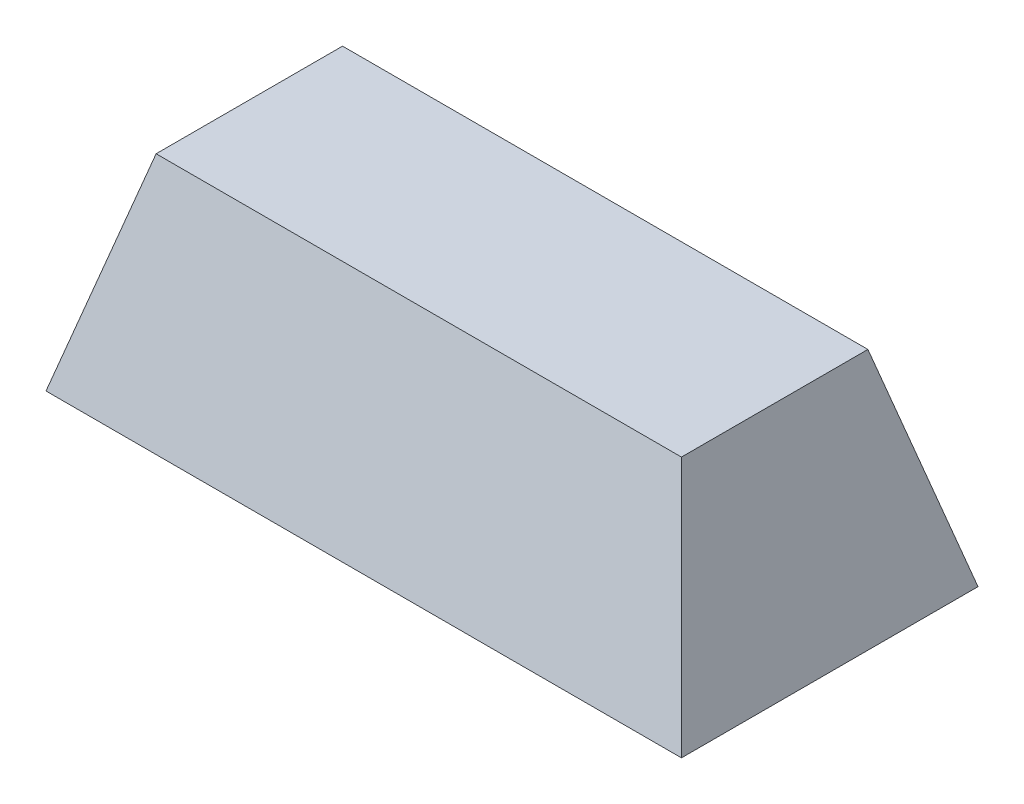
ISO-10303-21;
HEADER;
FILE_DESCRIPTION(('STEP AP214'),'2;1');
FILE_NAME('part.step','',(''),(''),'','','');
FILE_SCHEMA(('AUTOMOTIVE_DESIGN { 1 0 10303 214 1 1 1 1 }'));
ENDSEC;
DATA;
#1=APPLICATION_CONTEXT('core data for automotive mechanical design processes');
#2=APPLICATION_PROTOCOL_DEFINITION('international standard','automotive_design',2000,#1);
#3=PRODUCT_CONTEXT('',#1,'mechanical');
#4=PRODUCT('Part','Part','',(#3));
#5=PRODUCT_RELATED_PRODUCT_CATEGORY('part','',(#4));
#6=PRODUCT_DEFINITION_FORMATION('','',#4);
#7=PRODUCT_DEFINITION_CONTEXT('part definition',#1,'design');
#8=PRODUCT_DEFINITION('design','',#6,#7);
#9=PRODUCT_DEFINITION_SHAPE('','',#8);
#10=(LENGTH_UNIT() NAMED_UNIT(*) SI_UNIT(.MILLI.,.METRE.));
#11=(NAMED_UNIT(*) PLANE_ANGLE_UNIT() SI_UNIT($,.RADIAN.));
#12=(NAMED_UNIT(*) SI_UNIT($,.STERADIAN.) SOLID_ANGLE_UNIT());
#13=UNCERTAINTY_MEASURE_WITH_UNIT(LENGTH_MEASURE(1.E-05),#10,'distance_accuracy_value','');
#14=(GEOMETRIC_REPRESENTATION_CONTEXT(3) GLOBAL_UNCERTAINTY_ASSIGNED_CONTEXT((#13)) GLOBAL_UNIT_ASSIGNED_CONTEXT((#10,
#11,#12)) REPRESENTATION_CONTEXT('',''));
#15=CARTESIAN_POINT('',(0.,0.,0.));
#16=DIRECTION('',(0.,0.,1.));
#17=DIRECTION('',(1.,0.,0.));
#18=AXIS2_PLACEMENT_3D('',#15,#16,#17);
#19=CARTESIAN_POINT('',(0.,48.5,-70.));
#20=DIRECTION('',(0.,-1.,0.));
#21=DIRECTION('',(0.,0.,-1.));
#22=AXIS2_PLACEMENT_3D('',#19,#20,#21);
#23=PLANE('',#22);
#24=DIRECTION('',(0.,0.,1.));
#25=VECTOR('',#24,1.);
#26=CARTESIAN_POINT('',(12.9955358329097,48.5,-70.001));
#27=LINE('',#26,#25);
#28=CARTESIAN_POINT('',(12.9955358329097,48.5,-57.0044641670905));
#29=VERTEX_POINT('',#28);
#30=CARTESIAN_POINT('',(12.9955358329097,48.5,-12.9955358329095));
#31=VERTEX_POINT('',#30);
#32=EDGE_CURVE('E101',#29,#31,#27,.T.);
#33=ORIENTED_EDGE('',*,*,#32,.T.);
#34=DIRECTION('',(1.,0.,0.));
#35=VECTOR('',#34,1.);
#36=CARTESIAN_POINT('',(0.,48.5,-12.9955358329095));
#37=LINE('',#36,#35);
#38=CARTESIAN_POINT('',(137.00446416709,48.5,-12.9955358329095));
#39=VERTEX_POINT('',#38);
#40=EDGE_CURVE('E92',#31,#39,#37,.T.);
#41=ORIENTED_EDGE('',*,*,#40,.T.);
#42=DIRECTION('',(0.,0.,1.));
#43=VECTOR('',#42,1.);
#44=CARTESIAN_POINT('',(137.00446416709,48.5,-70.001));
#45=LINE('',#44,#43);
#46=CARTESIAN_POINT('',(137.00446416709,48.5,-57.0044641670905));
#47=VERTEX_POINT('',#46);
#48=EDGE_CURVE('E103',#47,#39,#45,.T.);
#49=ORIENTED_EDGE('',*,*,#48,.F.);
#50=DIRECTION('',(-1.,0.,0.));
#51=VECTOR('',#50,1.);
#52=CARTESIAN_POINT('',(0.,48.5,-57.0044641670905));
#53=LINE('',#52,#51);
#54=EDGE_CURVE('E87',#47,#29,#53,.T.);
#55=ORIENTED_EDGE('',*,*,#54,.T.);
#56=EDGE_LOOP('',(#33,#41,#49,#55));
#57=FACE_BOUND('',#56,.T.);
#58=ADVANCED_FACE('F31',(#57),#23,.F.);
#59=CARTESIAN_POINT('',(0.,0.,-70.));
#60=DIRECTION('',(0.,-1.,0.));
#61=DIRECTION('',(0.,0.,-1.));
#62=AXIS2_PLACEMENT_3D('',#59,#60,#61);
#63=PLANE('',#62);
#64=DIRECTION('',(0.,0.,1.));
#65=VECTOR('',#64,1.);
#66=CARTESIAN_POINT('',(0.,0.,0.));
#67=LINE('',#66,#65);
#68=CARTESIAN_POINT('',(0.,0.,-70.));
#69=VERTEX_POINT('',#68);
#70=CARTESIAN_POINT('',(0.,0.,0.));
#71=VERTEX_POINT('',#70);
#72=EDGE_CURVE('E85',#69,#71,#67,.T.);
#73=ORIENTED_EDGE('',*,*,#72,.F.);
#74=DIRECTION('',(-1.,0.,0.));
#75=VECTOR('',#74,1.);
#76=CARTESIAN_POINT('',(0.,0.,-70.));
#77=LINE('',#76,#75);
#78=CARTESIAN_POINT('',(150.,0.,-70.));
#79=VERTEX_POINT('',#78);
#80=EDGE_CURVE('E79',#79,#69,#77,.T.);
#81=ORIENTED_EDGE('',*,*,#80,.F.);
#82=DIRECTION('',(0.,0.,-1.));
#83=VECTOR('',#82,1.);
#84=CARTESIAN_POINT('',(150.,0.,0.));
#85=LINE('',#84,#83);
#86=CARTESIAN_POINT('',(150.,0.,0.));
#87=VERTEX_POINT('',#86);
#88=EDGE_CURVE('E70',#87,#79,#85,.T.);
#89=ORIENTED_EDGE('',*,*,#88,.F.);
#90=DIRECTION('',(1.,0.,0.));
#91=VECTOR('',#90,1.);
#92=CARTESIAN_POINT('',(0.,0.,0.));
#93=LINE('',#92,#91);
#94=EDGE_CURVE('E80',#71,#87,#93,.T.);
#95=ORIENTED_EDGE('',*,*,#94,.F.);
#96=EDGE_LOOP('',(#73,#81,#89,#95));
#97=FACE_BOUND('',#96,.T.);
#98=ADVANCED_FACE('F84',(#97),#63,.T.);
#99=CARTESIAN_POINT('',(12.9955358329097,48.5,-70.001));
#100=DIRECTION('',(0.965925826289067,-0.258819045102525,0.));
#101=DIRECTION('',(0.258819045102525,0.965925826289067,0.));
#102=AXIS2_PLACEMENT_3D('',#99,#100,#101);
#103=PLANE('',#102);
#104=ORIENTED_EDGE('',*,*,#72,.T.);
#105=DIRECTION('',(-0.250562807085736,-0.935113126531029,0.250562807085729));
#106=VECTOR('',#105,1.);
#107=CARTESIAN_POINT('',(12.1796537371684,45.4550865657078,-12.1796537371683));
#108=LINE('',#107,#106);
#109=EDGE_CURVE('E11',#71,#31,#108,.F.);
#110=ORIENTED_EDGE('',*,*,#109,.T.);
#111=ORIENTED_EDGE('',*,*,#32,.F.);
#112=DIRECTION('',(0.250562807085736,0.935113126531029,0.250562807085729));
#113=VECTOR('',#112,1.);
#114=CARTESIAN_POINT('',(12.1796537371684,45.4550865657078,-57.8203462628317));
#115=LINE('',#114,#113);
#116=EDGE_CURVE('E93',#29,#69,#115,.F.);
#117=ORIENTED_EDGE('',*,*,#116,.T.);
#118=EDGE_LOOP('',(#104,#110,#111,#117));
#119=FACE_BOUND('',#118,.T.);
#120=ADVANCED_FACE('F114',(#119),#103,.F.);
#121=CARTESIAN_POINT('',(137.00446416709,48.5,-70.001));
#122=DIRECTION('',(-0.965925826289067,-0.258819045102525,0.));
#123=DIRECTION('',(0.258819045102525,-0.965925826289067,0.));
#124=AXIS2_PLACEMENT_3D('',#121,#122,#123);
#125=PLANE('',#124);
#126=ORIENTED_EDGE('',*,*,#48,.T.);
#127=DIRECTION('',(-0.250562807085736,0.935113126531029,-0.250562807085729));
#128=VECTOR('',#127,1.);
#129=CARTESIAN_POINT('',(128.403088218629,80.6007720546579,-21.5969117813705));
#130=LINE('',#129,#128);
#131=EDGE_CURVE('E39',#39,#87,#130,.F.);
#132=ORIENTED_EDGE('',*,*,#131,.T.);
#133=ORIENTED_EDGE('',*,*,#88,.T.);
#134=DIRECTION('',(0.250562807085736,-0.935113126531029,-0.250562807085729));
#135=VECTOR('',#134,1.);
#136=CARTESIAN_POINT('',(128.403088218629,80.6007720546579,-48.4030882186294));
#137=LINE('',#136,#135);
#138=EDGE_CURVE('E75',#79,#47,#137,.F.);
#139=ORIENTED_EDGE('',*,*,#138,.T.);
#140=EDGE_LOOP('',(#126,#132,#133,#139));
#141=FACE_BOUND('',#140,.T.);
#142=ADVANCED_FACE('F73',(#141),#125,.F.);
#143=CARTESIAN_POINT('',(0.,48.5,-57.0044641670905));
#144=DIRECTION('',(0.,-0.258819045102519,0.965925826289069));
#145=DIRECTION('',(0.,-0.965925826289069,-0.258819045102519));
#146=AXIS2_PLACEMENT_3D('',#143,#144,#145);
#147=PLANE('',#146);
#148=ORIENTED_EDGE('',*,*,#138,.F.);
#149=ORIENTED_EDGE('',*,*,#80,.T.);
#150=ORIENTED_EDGE('',*,*,#116,.F.);
#151=ORIENTED_EDGE('',*,*,#54,.F.);
#152=EDGE_LOOP('',(#148,#149,#150,#151));
#153=FACE_BOUND('',#152,.T.);
#154=ADVANCED_FACE('F90',(#153),#147,.F.);
#155=CARTESIAN_POINT('',(0.,48.5,-12.9955358329095));
#156=DIRECTION('',(0.,-0.258819045102519,-0.965925826289069));
#157=DIRECTION('',(0.,0.965925826289069,-0.258819045102519));
#158=AXIS2_PLACEMENT_3D('',#155,#156,#157);
#159=PLANE('',#158);
#160=ORIENTED_EDGE('',*,*,#109,.F.);
#161=ORIENTED_EDGE('',*,*,#94,.T.);
#162=ORIENTED_EDGE('',*,*,#131,.F.);
#163=ORIENTED_EDGE('',*,*,#40,.F.);
#164=EDGE_LOOP('',(#160,#161,#162,#163));
#165=FACE_BOUND('',#164,.T.);
#166=ADVANCED_FACE('F33',(#165),#159,.F.);
#167=CLOSED_SHELL('',(#58,#98,#120,#142,#154,#166));
#168=MANIFOLD_SOLID_BREP('B2',#167);
#169=ADVANCED_BREP_SHAPE_REPRESENTATION('',(#18,#168),#14);
#170=SHAPE_DEFINITION_REPRESENTATION(#9,#169);
ENDSEC;
END-ISO-10303-21;
